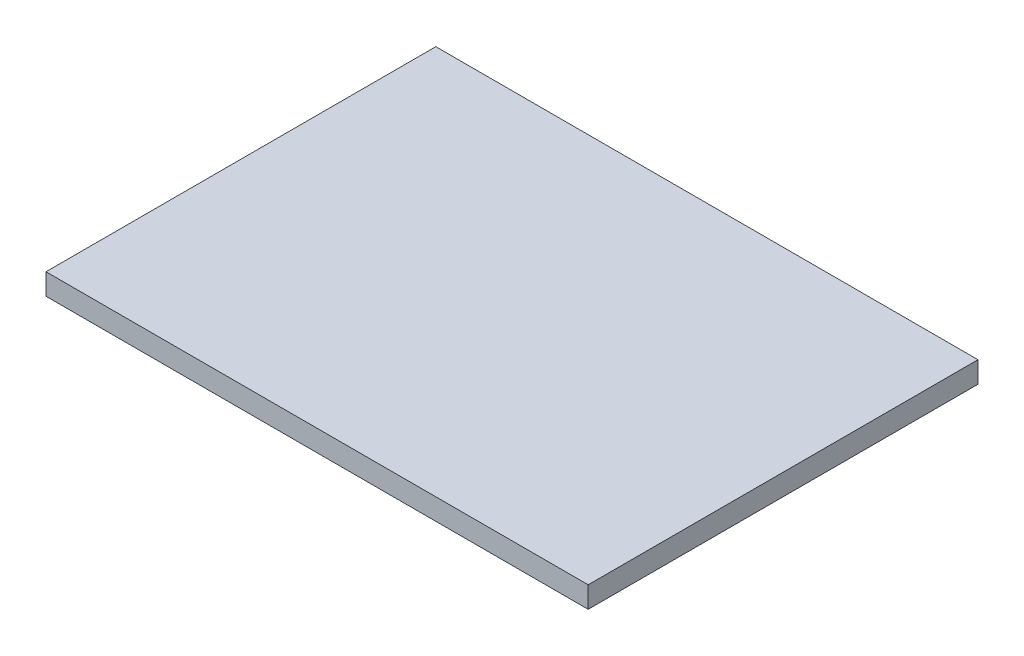
ISO-10303-21;
HEADER;
FILE_DESCRIPTION(('STEP AP214'),'2;1');
FILE_NAME('part.step','',(''),(''),'','','');
FILE_SCHEMA(('AUTOMOTIVE_DESIGN { 1 0 10303 214 1 1 1 1 }'));
ENDSEC;
DATA;
#1=APPLICATION_CONTEXT('core data for automotive mechanical design processes');
#2=APPLICATION_PROTOCOL_DEFINITION('international standard','automotive_design',2000,#1);
#3=PRODUCT_CONTEXT('',#1,'mechanical');
#4=PRODUCT('Part','Part','',(#3));
#5=PRODUCT_RELATED_PRODUCT_CATEGORY('part','',(#4));
#6=PRODUCT_DEFINITION_FORMATION('','',#4);
#7=PRODUCT_DEFINITION_CONTEXT('part definition',#1,'design');
#8=PRODUCT_DEFINITION('design','',#6,#7);
#9=PRODUCT_DEFINITION_SHAPE('','',#8);
#10=(LENGTH_UNIT() NAMED_UNIT(*) SI_UNIT(.MILLI.,.METRE.));
#11=(NAMED_UNIT(*) PLANE_ANGLE_UNIT() SI_UNIT($,.RADIAN.));
#12=(NAMED_UNIT(*) SI_UNIT($,.STERADIAN.) SOLID_ANGLE_UNIT());
#13=UNCERTAINTY_MEASURE_WITH_UNIT(LENGTH_MEASURE(1.E-05),#10,'distance_accuracy_value','');
#14=(GEOMETRIC_REPRESENTATION_CONTEXT(3) GLOBAL_UNCERTAINTY_ASSIGNED_CONTEXT((#13)) GLOBAL_UNIT_ASSIGNED_CONTEXT((#10,
#11,#12)) REPRESENTATION_CONTEXT('',''));
#15=CARTESIAN_POINT('',(0.,0.,0.));
#16=DIRECTION('',(0.,0.,1.));
#17=DIRECTION('',(1.,0.,0.));
#18=AXIS2_PLACEMENT_3D('',#15,#16,#17);
#19=CARTESIAN_POINT('',(102.,6.,-125.));
#20=DIRECTION('',(0.,0.,1.));
#21=DIRECTION('',(1.,0.,0.));
#22=AXIS2_PLACEMENT_3D('',#19,#20,#21);
#23=PLANE('',#22);
#24=DIRECTION('',(-1.,0.,0.));
#25=VECTOR('',#24,1.);
#26=CARTESIAN_POINT('',(102.,0.,-125.));
#27=LINE('',#26,#25);
#28=CARTESIAN_POINT('',(255.,0.,-125.));
#29=VERTEX_POINT('',#28);
#30=CARTESIAN_POINT('',(102.,0.,-125.));
#31=VERTEX_POINT('',#30);
#32=EDGE_CURVE('E97',#29,#31,#27,.T.);
#33=ORIENTED_EDGE('',*,*,#32,.T.);
#34=DIRECTION('',(0.,-1.,0.));
#35=VECTOR('',#34,1.);
#36=CARTESIAN_POINT('',(102.,6.,-125.));
#37=LINE('',#36,#35);
#38=CARTESIAN_POINT('',(102.,6.,-125.));
#39=VERTEX_POINT('',#38);
#40=EDGE_CURVE('E11',#39,#31,#37,.T.);
#41=ORIENTED_EDGE('',*,*,#40,.F.);
#42=DIRECTION('',(-1.,0.,0.));
#43=VECTOR('',#42,1.);
#44=CARTESIAN_POINT('',(102.,6.,-125.));
#45=LINE('',#44,#43);
#46=CARTESIAN_POINT('',(255.,6.,-125.));
#47=VERTEX_POINT('',#46);
#48=EDGE_CURVE('E85',#47,#39,#45,.T.);
#49=ORIENTED_EDGE('',*,*,#48,.F.);
#50=DIRECTION('',(0.,-1.,0.));
#51=VECTOR('',#50,1.);
#52=CARTESIAN_POINT('',(255.,6.,-125.));
#53=LINE('',#52,#51);
#54=EDGE_CURVE('E93',#47,#29,#53,.T.);
#55=ORIENTED_EDGE('',*,*,#54,.T.);
#56=EDGE_LOOP('',(#33,#41,#49,#55));
#57=FACE_BOUND('',#56,.T.);
#58=ADVANCED_FACE('F34',(#57),#23,.F.);
#59=CARTESIAN_POINT('',(102.,6.,-125.));
#60=DIRECTION('',(1.,0.,0.));
#61=DIRECTION('',(0.,0.,-1.));
#62=AXIS2_PLACEMENT_3D('',#59,#60,#61);
#63=PLANE('',#62);
#64=DIRECTION('',(0.,0.,1.));
#65=VECTOR('',#64,1.);
#66=CARTESIAN_POINT('',(102.,0.,-125.));
#67=LINE('',#66,#65);
#68=CARTESIAN_POINT('',(102.,0.,-15.));
#69=VERTEX_POINT('',#68);
#70=EDGE_CURVE('E89',#31,#69,#67,.T.);
#71=ORIENTED_EDGE('',*,*,#70,.T.);
#72=DIRECTION('',(0.,-1.,0.));
#73=VECTOR('',#72,1.);
#74=CARTESIAN_POINT('',(102.,6.,-15.));
#75=LINE('',#74,#73);
#76=CARTESIAN_POINT('',(102.,6.,-15.));
#77=VERTEX_POINT('',#76);
#78=EDGE_CURVE('E42',#77,#69,#75,.T.);
#79=ORIENTED_EDGE('',*,*,#78,.F.);
#80=DIRECTION('',(0.,0.,1.));
#81=VECTOR('',#80,1.);
#82=CARTESIAN_POINT('',(102.,6.,-125.));
#83=LINE('',#82,#81);
#84=EDGE_CURVE('E80',#39,#77,#83,.T.);
#85=ORIENTED_EDGE('',*,*,#84,.F.);
#86=ORIENTED_EDGE('',*,*,#40,.T.);
#87=EDGE_LOOP('',(#71,#79,#85,#86));
#88=FACE_BOUND('',#87,.T.);
#89=ADVANCED_FACE('F88',(#88),#63,.F.);
#90=CARTESIAN_POINT('',(102.,6.,-15.));
#91=DIRECTION('',(0.,0.,-1.));
#92=DIRECTION('',(-1.,0.,0.));
#93=AXIS2_PLACEMENT_3D('',#90,#91,#92);
#94=PLANE('',#93);
#95=DIRECTION('',(1.,0.,0.));
#96=VECTOR('',#95,1.);
#97=CARTESIAN_POINT('',(102.,0.,-15.));
#98=LINE('',#97,#96);
#99=CARTESIAN_POINT('',(255.,0.,-15.));
#100=VERTEX_POINT('',#99);
#101=EDGE_CURVE('E67',#69,#100,#98,.T.);
#102=ORIENTED_EDGE('',*,*,#101,.T.);
#103=DIRECTION('',(0.,-1.,0.));
#104=VECTOR('',#103,1.);
#105=CARTESIAN_POINT('',(255.,6.,-15.));
#106=LINE('',#105,#104);
#107=CARTESIAN_POINT('',(255.,6.,-15.));
#108=VERTEX_POINT('',#107);
#109=EDGE_CURVE('E90',#108,#100,#106,.T.);
#110=ORIENTED_EDGE('',*,*,#109,.F.);
#111=DIRECTION('',(1.,0.,0.));
#112=VECTOR('',#111,1.);
#113=CARTESIAN_POINT('',(102.,6.,-15.));
#114=LINE('',#113,#112);
#115=EDGE_CURVE('E83',#77,#108,#114,.T.);
#116=ORIENTED_EDGE('',*,*,#115,.F.);
#117=ORIENTED_EDGE('',*,*,#78,.T.);
#118=EDGE_LOOP('',(#102,#110,#116,#117));
#119=FACE_BOUND('',#118,.T.);
#120=ADVANCED_FACE('F91',(#119),#94,.F.);
#121=CARTESIAN_POINT('',(255.,6.,-15.));
#122=DIRECTION('',(-1.,0.,0.));
#123=DIRECTION('',(0.,0.,1.));
#124=AXIS2_PLACEMENT_3D('',#121,#122,#123);
#125=PLANE('',#124);
#126=DIRECTION('',(0.,0.,-1.));
#127=VECTOR('',#126,1.);
#128=CARTESIAN_POINT('',(255.,0.,-15.));
#129=LINE('',#128,#127);
#130=EDGE_CURVE('E73',#100,#29,#129,.T.);
#131=ORIENTED_EDGE('',*,*,#130,.T.);
#132=ORIENTED_EDGE('',*,*,#54,.F.);
#133=DIRECTION('',(0.,0.,-1.));
#134=VECTOR('',#133,1.);
#135=CARTESIAN_POINT('',(255.,6.,-15.));
#136=LINE('',#135,#134);
#137=EDGE_CURVE('E50',#108,#47,#136,.T.);
#138=ORIENTED_EDGE('',*,*,#137,.F.);
#139=ORIENTED_EDGE('',*,*,#109,.T.);
#140=EDGE_LOOP('',(#131,#132,#138,#139));
#141=FACE_BOUND('',#140,.T.);
#142=ADVANCED_FACE('F104',(#141),#125,.F.);
#143=CARTESIAN_POINT('',(0.,6.,0.));
#144=DIRECTION('',(0.,1.,0.));
#145=DIRECTION('',(0.,0.,1.));
#146=AXIS2_PLACEMENT_3D('',#143,#144,#145);
#147=PLANE('',#146);
#148=ORIENTED_EDGE('',*,*,#48,.T.);
#149=ORIENTED_EDGE('',*,*,#84,.T.);
#150=ORIENTED_EDGE('',*,*,#115,.T.);
#151=ORIENTED_EDGE('',*,*,#137,.T.);
#152=EDGE_LOOP('',(#148,#149,#150,#151));
#153=FACE_BOUND('',#152,.T.);
#154=ADVANCED_FACE('F81',(#153),#147,.T.);
#155=CARTESIAN_POINT('',(0.,0.,0.));
#156=DIRECTION('',(0.,1.,0.));
#157=DIRECTION('',(0.,0.,1.));
#158=AXIS2_PLACEMENT_3D('',#155,#156,#157);
#159=PLANE('',#158);
#160=ORIENTED_EDGE('',*,*,#32,.F.);
#161=ORIENTED_EDGE('',*,*,#130,.F.);
#162=ORIENTED_EDGE('',*,*,#101,.F.);
#163=ORIENTED_EDGE('',*,*,#70,.F.);
#164=EDGE_LOOP('',(#160,#161,#162,#163));
#165=FACE_BOUND('',#164,.T.);
#166=ADVANCED_FACE('F107',(#165),#159,.F.);
#167=CLOSED_SHELL('',(#58,#89,#120,#142,#154,#166));
#168=MANIFOLD_SOLID_BREP('B2',#167);
#169=ADVANCED_BREP_SHAPE_REPRESENTATION('',(#18,#168),#14);
#170=SHAPE_DEFINITION_REPRESENTATION(#9,#169);
ENDSEC;
END-ISO-10303-21;
